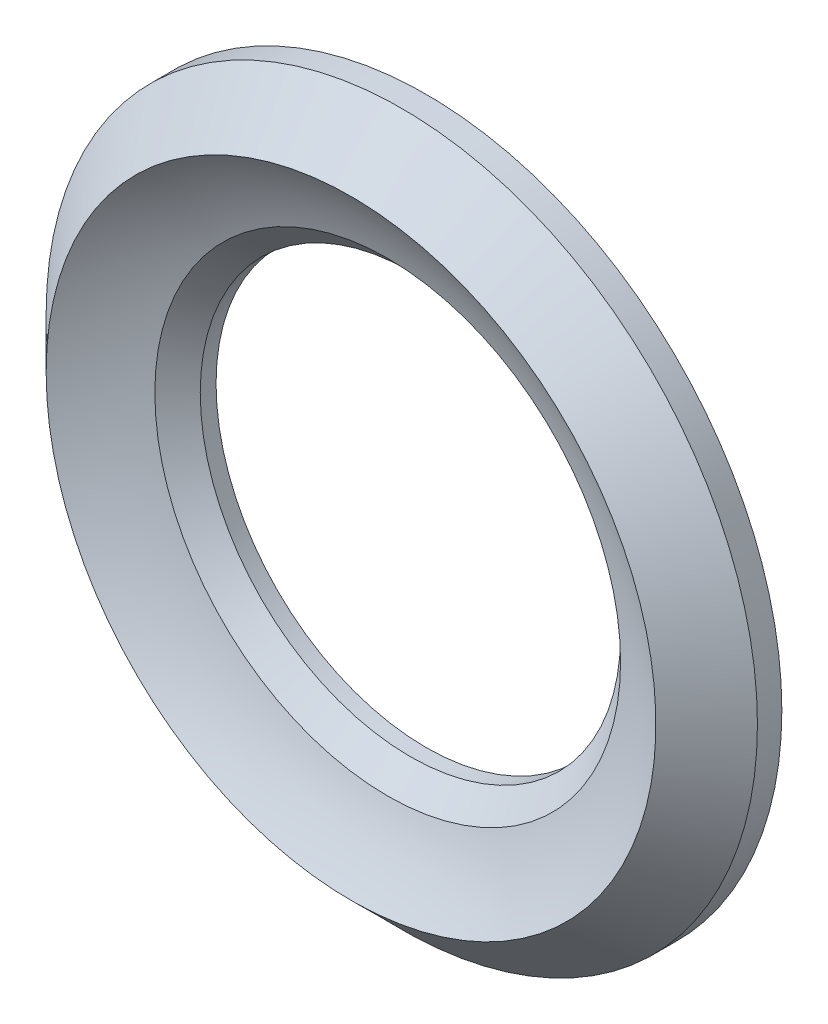
ISO-10303-21;
HEADER;
FILE_DESCRIPTION(('STEP AP214'),'2;1');
FILE_NAME('part.step','',(''),(''),'','','');
FILE_SCHEMA(('AUTOMOTIVE_DESIGN { 1 0 10303 214 1 1 1 1 }'));
ENDSEC;
DATA;
#1=APPLICATION_CONTEXT('core data for automotive mechanical design processes');
#2=APPLICATION_PROTOCOL_DEFINITION('international standard','automotive_design',2000,#1);
#3=PRODUCT_CONTEXT('',#1,'mechanical');
#4=PRODUCT('Part','Part','',(#3));
#5=PRODUCT_RELATED_PRODUCT_CATEGORY('part','',(#4));
#6=PRODUCT_DEFINITION_FORMATION('','',#4);
#7=PRODUCT_DEFINITION_CONTEXT('part definition',#1,'design');
#8=PRODUCT_DEFINITION('design','',#6,#7);
#9=PRODUCT_DEFINITION_SHAPE('','',#8);
#10=(LENGTH_UNIT() NAMED_UNIT(*) SI_UNIT(.MILLI.,.METRE.));
#11=(NAMED_UNIT(*) PLANE_ANGLE_UNIT() SI_UNIT($,.RADIAN.));
#12=(NAMED_UNIT(*) SI_UNIT($,.STERADIAN.) SOLID_ANGLE_UNIT());
#13=UNCERTAINTY_MEASURE_WITH_UNIT(LENGTH_MEASURE(1.E-05),#10,'distance_accuracy_value','');
#14=(GEOMETRIC_REPRESENTATION_CONTEXT(3) GLOBAL_UNCERTAINTY_ASSIGNED_CONTEXT((#13)) GLOBAL_UNIT_ASSIGNED_CONTEXT((#10,
#11,#12)) REPRESENTATION_CONTEXT('',''));
#15=CARTESIAN_POINT('',(0.,0.,0.));
#16=DIRECTION('',(0.,0.,1.));
#17=DIRECTION('',(1.,0.,0.));
#18=AXIS2_PLACEMENT_3D('',#15,#16,#17);
#19=CARTESIAN_POINT('',(0.,22.,3.99999999999999));
#20=DIRECTION('',(0.,0.,-1.));
#21=DIRECTION('',(-1.,0.,0.));
#22=AXIS2_PLACEMENT_3D('',#19,#20,#21);
#23=PLANE('',#22);
#24=CARTESIAN_POINT('',(-6.69696006638897,-16.1678918189476,3.99999999999999));
#25=DIRECTION('',(0.,0.,-1.));
#26=DIRECTION('',(-1.,0.,0.));
#27=AXIS2_PLACEMENT_3D('',#24,#25,#26);
#28=CIRCLE('',#27,0.799999999999998);
#29=CARTESIAN_POINT('',(-7.49696006638897,-16.1678918189476,3.99999999999999));
#30=VERTEX_POINT('',#29);
#31=EDGE_CURVE('E76',#30,#30,#28,.T.);
#32=ORIENTED_EDGE('',*,*,#31,.F.);
#33=EDGE_LOOP('',(#32));
#34=FACE_BOUND('',#33,.T.);
#35=CARTESIAN_POINT('',(16.1678918189475,-6.69696006638914,3.99999999999999));
#36=DIRECTION('',(0.,0.,-1.));
#37=DIRECTION('',(-1.,0.,0.));
#38=AXIS2_PLACEMENT_3D('',#35,#36,#37);
#39=CIRCLE('',#38,0.799999999999997);
#40=CARTESIAN_POINT('',(15.3678918189475,-6.69696006638914,3.99999999999999));
#41=VERTEX_POINT('',#40);
#42=EDGE_CURVE('E84',#41,#41,#39,.T.);
#43=ORIENTED_EDGE('',*,*,#42,.F.);
#44=EDGE_LOOP('',(#43));
#45=FACE_BOUND('',#44,.T.);
#46=CARTESIAN_POINT('',(6.69696006638897,-16.1678918189476,3.99999999999999));
#47=DIRECTION('',(0.,0.,-1.));
#48=DIRECTION('',(-1.,0.,0.));
#49=AXIS2_PLACEMENT_3D('',#46,#47,#48);
#50=CIRCLE('',#49,0.799999999999998);
#51=CARTESIAN_POINT('',(5.89696006638898,-16.1678918189476,3.99999999999999));
#52=VERTEX_POINT('',#51);
#53=EDGE_CURVE('E88',#52,#52,#50,.T.);
#54=ORIENTED_EDGE('',*,*,#53,.F.);
#55=EDGE_LOOP('',(#54));
#56=FACE_BOUND('',#55,.T.);
#57=CARTESIAN_POINT('',(-16.1678918189475,-6.69696006638914,3.99999999999999));
#58=DIRECTION('',(0.,0.,-1.));
#59=DIRECTION('',(-1.,0.,0.));
#60=AXIS2_PLACEMENT_3D('',#57,#58,#59);
#61=CIRCLE('',#60,0.799999999999998);
#62=CARTESIAN_POINT('',(-16.9678918189475,-6.69696006638914,3.99999999999999));
#63=VERTEX_POINT('',#62);
#64=EDGE_CURVE('E92',#63,#63,#61,.T.);
#65=ORIENTED_EDGE('',*,*,#64,.F.);
#66=EDGE_LOOP('',(#65));
#67=FACE_BOUND('',#66,.T.);
#68=CARTESIAN_POINT('',(-6.69696006638897,16.1678918189476,3.99999999999999));
#69=DIRECTION('',(0.,0.,-1.));
#70=DIRECTION('',(-1.,0.,0.));
#71=AXIS2_PLACEMENT_3D('',#68,#69,#70);
#72=CIRCLE('',#71,0.799999999999998);
#73=CARTESIAN_POINT('',(-7.49696006638897,16.1678918189476,3.99999999999999));
#74=VERTEX_POINT('',#73);
#75=EDGE_CURVE('E96',#74,#74,#72,.T.);
#76=ORIENTED_EDGE('',*,*,#75,.F.);
#77=EDGE_LOOP('',(#76));
#78=FACE_BOUND('',#77,.T.);
#79=CARTESIAN_POINT('',(16.1678918189475,6.69696006638914,3.99999999999999));
#80=DIRECTION('',(0.,0.,-1.));
#81=DIRECTION('',(-1.,0.,0.));
#82=AXIS2_PLACEMENT_3D('',#79,#80,#81);
#83=CIRCLE('',#82,0.799999999999997);
#84=CARTESIAN_POINT('',(15.3678918189475,6.69696006638914,3.99999999999999));
#85=VERTEX_POINT('',#84);
#86=EDGE_CURVE('E100',#85,#85,#83,.T.);
#87=ORIENTED_EDGE('',*,*,#86,.F.);
#88=EDGE_LOOP('',(#87));
#89=FACE_BOUND('',#88,.T.);
#90=CARTESIAN_POINT('',(6.69696006638897,16.1678918189476,3.99999999999999));
#91=DIRECTION('',(0.,0.,-1.));
#92=DIRECTION('',(-1.,0.,0.));
#93=AXIS2_PLACEMENT_3D('',#90,#91,#92);
#94=CIRCLE('',#93,0.799999999999998);
#95=CARTESIAN_POINT('',(5.89696006638898,16.1678918189476,3.99999999999999));
#96=VERTEX_POINT('',#95);
#97=EDGE_CURVE('E104',#96,#96,#94,.T.);
#98=ORIENTED_EDGE('',*,*,#97,.F.);
#99=EDGE_LOOP('',(#98));
#100=FACE_BOUND('',#99,.T.);
#101=CARTESIAN_POINT('',(-16.1678918189475,6.69696006638914,3.99999999999999));
#102=DIRECTION('',(0.,0.,-1.));
#103=DIRECTION('',(-1.,0.,0.));
#104=AXIS2_PLACEMENT_3D('',#101,#102,#103);
#105=CIRCLE('',#104,0.799999999999998);
#106=CARTESIAN_POINT('',(-16.9678918189475,6.69696006638914,3.99999999999999));
#107=VERTEX_POINT('',#106);
#108=EDGE_CURVE('E108',#107,#107,#105,.T.);
#109=ORIENTED_EDGE('',*,*,#108,.F.);
#110=EDGE_LOOP('',(#109));
#111=FACE_BOUND('',#110,.T.);
#112=CARTESIAN_POINT('',(0.,0.,3.99999999999999));
#113=DIRECTION('',(0.,0.,-1.));
#114=DIRECTION('',(-1.,0.,0.));
#115=AXIS2_PLACEMENT_3D('',#112,#113,#114);
#116=CIRCLE('',#115,22.);
#117=CARTESIAN_POINT('',(-22.,0.,3.99999999999999));
#118=VERTEX_POINT('',#117);
#119=EDGE_CURVE('E109',#118,#118,#116,.T.);
#120=ORIENTED_EDGE('',*,*,#119,.T.);
#121=EDGE_LOOP('',(#120));
#122=FACE_BOUND('',#121,.T.);
#123=CARTESIAN_POINT('',(0.,0.,3.99999999999999));
#124=DIRECTION('',(0.,0.,-1.));
#125=DIRECTION('',(-1.,0.,0.));
#126=AXIS2_PLACEMENT_3D('',#123,#124,#125);
#127=CIRCLE('',#126,13.);
#128=CARTESIAN_POINT('',(-13.,0.,3.99999999999999));
#129=VERTEX_POINT('',#128);
#130=EDGE_CURVE('E118',#129,#129,#127,.T.);
#131=ORIENTED_EDGE('',*,*,#130,.F.);
#132=EDGE_LOOP('',(#131));
#133=FACE_BOUND('',#132,.T.);
#134=ADVANCED_FACE('F33',(#34,#45,#56,#67,#78,#89,#100,#111,#122,#133),#23,.T.);
#135=CARTESIAN_POINT('',(0.,0.,0.));
#136=DIRECTION('',(0.,0.,-1.));
#137=DIRECTION('',(-1.,0.,0.));
#138=AXIS2_PLACEMENT_3D('',#135,#136,#137);
#139=CYLINDRICAL_SURFACE('',#138,13.);
#140=CARTESIAN_POINT('',(0.,0.,4.9772883581417));
#141=DIRECTION('',(0.,0.,1.));
#142=DIRECTION('',(1.,0.,0.));
#143=AXIS2_PLACEMENT_3D('',#140,#141,#142);
#144=CIRCLE('',#143,13.);
#145=CARTESIAN_POINT('',(13.,0.,4.9772883581417));
#146=VERTEX_POINT('',#145);
#147=EDGE_CURVE('E11',#146,#146,#144,.T.);
#148=ORIENTED_EDGE('',*,*,#147,.T.);
#149=EDGE_LOOP('',(#148));
#150=FACE_BOUND('',#149,.T.);
#151=ORIENTED_EDGE('',*,*,#130,.T.);
#152=EDGE_LOOP('',(#151));
#153=FACE_BOUND('',#152,.T.);
#154=ADVANCED_FACE('F149',(#150,#153),#139,.F.);
#155=CARTESIAN_POINT('',(0.,0.,22.5));
#156=DIRECTION('',(0.,0.,-1.));
#157=DIRECTION('',(-1.,0.,0.));
#158=AXIS2_PLACEMENT_3D('',#155,#156,#157);
#159=DEGENERATE_TOROIDAL_SURFACE('',#158,9.,17.,.T.);
#160=CARTESIAN_POINT('',(0.,0.,6.38203882723148));
#161=DIRECTION('',(0.,0.,1.));
#162=DIRECTION('',(1.,0.,0.));
#163=AXIS2_PLACEMENT_3D('',#160,#161,#162);
#164=CIRCLE('',#163,14.4047504690898);
#165=CARTESIAN_POINT('',(14.4047504690898,0.,6.38203882723148));
#166=VERTEX_POINT('',#165);
#167=EDGE_CURVE('E41',#166,#166,#164,.F.);
#168=ORIENTED_EDGE('',*,*,#167,.T.);
#169=EDGE_LOOP('',(#168));
#170=FACE_BOUND('',#169,.T.);
#171=CARTESIAN_POINT('',(0.,0.,8.65090884748535));
#172=DIRECTION('',(0.,0.,-1.));
#173=DIRECTION('',(-1.,0.,0.));
#174=AXIS2_PLACEMENT_3D('',#171,#172,#173);
#175=CIRCLE('',#174,18.8591416588535);
#176=CARTESIAN_POINT('',(-18.8591416588535,0.,8.65090884748535));
#177=VERTEX_POINT('',#176);
#178=EDGE_CURVE('E115',#177,#177,#175,.T.);
#179=ORIENTED_EDGE('',*,*,#178,.F.);
#180=EDGE_LOOP('',(#179));
#181=FACE_BOUND('',#180,.T.);
#182=ADVANCED_FACE('F137',(#170,#181),#159,.F.);
#183=CARTESIAN_POINT('',(0.,0.,5.51005050633884));
#184=DIRECTION('',(0.,0.,-1.));
#185=DIRECTION('',(-1.,0.,0.));
#186=AXIS2_PLACEMENT_3D('',#183,#184,#185);
#187=CONICAL_SURFACE('',#186,22.,0.785398163397448);
#188=ORIENTED_EDGE('',*,*,#178,.T.);
#189=EDGE_LOOP('',(#188));
#190=FACE_BOUND('',#189,.T.);
#191=CARTESIAN_POINT('',(0.,0.,5.51005050633884));
#192=DIRECTION('',(0.,0.,-1.));
#193=DIRECTION('',(-1.,0.,0.));
#194=AXIS2_PLACEMENT_3D('',#191,#192,#193);
#195=CIRCLE('',#194,22.);
#196=CARTESIAN_POINT('',(-22.,0.,5.51005050633884));
#197=VERTEX_POINT('',#196);
#198=EDGE_CURVE('E112',#197,#197,#195,.T.);
#199=ORIENTED_EDGE('',*,*,#198,.F.);
#200=EDGE_LOOP('',(#199));
#201=FACE_BOUND('',#200,.T.);
#202=ADVANCED_FACE('F161',(#190,#201),#187,.T.);
#203=CARTESIAN_POINT('',(0.,0.,0.));
#204=DIRECTION('',(0.,0.,-1.));
#205=DIRECTION('',(-1.,0.,0.));
#206=AXIS2_PLACEMENT_3D('',#203,#204,#205);
#207=CYLINDRICAL_SURFACE('',#206,22.);
#208=ORIENTED_EDGE('',*,*,#198,.T.);
#209=EDGE_LOOP('',(#208));
#210=FACE_BOUND('',#209,.T.);
#211=ORIENTED_EDGE('',*,*,#119,.F.);
#212=EDGE_LOOP('',(#211));
#213=FACE_BOUND('',#212,.T.);
#214=ADVANCED_FACE('F164',(#210,#213),#207,.T.);
#215=CARTESIAN_POINT('',(-16.1678918189475,6.69696006638914,6.5));
#216=DIRECTION('',(0.,0.,-1.));
#217=DIRECTION('',(0.,1.,0.));
#218=AXIS2_PLACEMENT_3D('',#215,#216,#217);
#219=CONICAL_SURFACE('',#218,0.799999999999997,1.02974425867665);
#220=CARTESIAN_POINT('',(-16.1678918189475,6.69696006638914,6.98068849522205));
#221=VERTEX_POINT('',#220);
#222=VERTEX_LOOP('',#221);
#223=FACE_BOUND('',#222,.T.);
#224=CARTESIAN_POINT('',(-16.1678918189475,6.69696006638914,6.5));
#225=DIRECTION('',(0.,0.,-1.));
#226=DIRECTION('',(0.,1.,0.));
#227=AXIS2_PLACEMENT_3D('',#224,#225,#226);
#228=CIRCLE('',#227,0.799999999999997);
#229=CARTESIAN_POINT('',(-16.1678918189475,7.49696006638914,6.5));
#230=VERTEX_POINT('',#229);
#231=EDGE_CURVE('E105',#230,#230,#228,.T.);
#232=ORIENTED_EDGE('',*,*,#231,.T.);
#233=EDGE_LOOP('',(#232));
#234=FACE_BOUND('',#233,.T.);
#235=ADVANCED_FACE('F168',(#223,#234),#219,.F.);
#236=CARTESIAN_POINT('',(-16.1678918189475,6.69696006638914,-5.5));
#237=DIRECTION('',(0.,0.,-1.));
#238=DIRECTION('',(0.,1.,0.));
#239=AXIS2_PLACEMENT_3D('',#236,#237,#238);
#240=CYLINDRICAL_SURFACE('',#239,0.799999999999998);
#241=ORIENTED_EDGE('',*,*,#108,.T.);
#242=EDGE_LOOP('',(#241));
#243=FACE_BOUND('',#242,.T.);
#244=ORIENTED_EDGE('',*,*,#231,.F.);
#245=EDGE_LOOP('',(#244));
#246=FACE_BOUND('',#245,.T.);
#247=ADVANCED_FACE('F172',(#243,#246),#240,.F.);
#248=CARTESIAN_POINT('',(6.69696006638897,16.1678918189476,6.5));
#249=DIRECTION('',(0.,0.,-1.));
#250=DIRECTION('',(0.,1.,0.));
#251=AXIS2_PLACEMENT_3D('',#248,#249,#250);
#252=CONICAL_SURFACE('',#251,0.799999999999997,1.02974425867665);
#253=CARTESIAN_POINT('',(6.69696006638897,16.1678918189476,6.98068849522205));
#254=VERTEX_POINT('',#253);
#255=VERTEX_LOOP('',#254);
#256=FACE_BOUND('',#255,.T.);
#257=CARTESIAN_POINT('',(6.69696006638897,16.1678918189476,6.5));
#258=DIRECTION('',(0.,0.,-1.));
#259=DIRECTION('',(0.,1.,0.));
#260=AXIS2_PLACEMENT_3D('',#257,#258,#259);
#261=CIRCLE('',#260,0.799999999999997);
#262=CARTESIAN_POINT('',(6.69696006638897,16.9678918189476,6.5));
#263=VERTEX_POINT('',#262);
#264=EDGE_CURVE('E101',#263,#263,#261,.T.);
#265=ORIENTED_EDGE('',*,*,#264,.T.);
#266=EDGE_LOOP('',(#265));
#267=FACE_BOUND('',#266,.T.);
#268=ADVANCED_FACE('F175',(#256,#267),#252,.F.);
#269=CARTESIAN_POINT('',(6.69696006638897,16.1678918189476,-5.5));
#270=DIRECTION('',(0.,0.,-1.));
#271=DIRECTION('',(0.,1.,0.));
#272=AXIS2_PLACEMENT_3D('',#269,#270,#271);
#273=CYLINDRICAL_SURFACE('',#272,0.799999999999998);
#274=ORIENTED_EDGE('',*,*,#97,.T.);
#275=EDGE_LOOP('',(#274));
#276=FACE_BOUND('',#275,.T.);
#277=ORIENTED_EDGE('',*,*,#264,.F.);
#278=EDGE_LOOP('',(#277));
#279=FACE_BOUND('',#278,.T.);
#280=ADVANCED_FACE('F179',(#276,#279),#273,.F.);
#281=CARTESIAN_POINT('',(16.1678918189475,6.69696006638914,6.5));
#282=DIRECTION('',(0.,0.,-1.));
#283=DIRECTION('',(0.,1.,0.));
#284=AXIS2_PLACEMENT_3D('',#281,#282,#283);
#285=CONICAL_SURFACE('',#284,0.799999999999995,1.02974425867665);
#286=CARTESIAN_POINT('',(16.1678918189475,6.69696006638914,6.98068849522205));
#287=VERTEX_POINT('',#286);
#288=VERTEX_LOOP('',#287);
#289=FACE_BOUND('',#288,.T.);
#290=CARTESIAN_POINT('',(16.1678918189475,6.69696006638914,6.5));
#291=DIRECTION('',(0.,0.,-1.));
#292=DIRECTION('',(0.,1.,0.));
#293=AXIS2_PLACEMENT_3D('',#290,#291,#292);
#294=CIRCLE('',#293,0.799999999999995);
#295=CARTESIAN_POINT('',(16.1678918189475,7.49696006638913,6.5));
#296=VERTEX_POINT('',#295);
#297=EDGE_CURVE('E97',#296,#296,#294,.T.);
#298=ORIENTED_EDGE('',*,*,#297,.T.);
#299=EDGE_LOOP('',(#298));
#300=FACE_BOUND('',#299,.T.);
#301=ADVANCED_FACE('F182',(#289,#300),#285,.F.);
#302=CARTESIAN_POINT('',(16.1678918189475,6.69696006638914,-5.5));
#303=DIRECTION('',(0.,0.,-1.));
#304=DIRECTION('',(0.,1.,0.));
#305=AXIS2_PLACEMENT_3D('',#302,#303,#304);
#306=CYLINDRICAL_SURFACE('',#305,0.799999999999997);
#307=ORIENTED_EDGE('',*,*,#86,.T.);
#308=EDGE_LOOP('',(#307));
#309=FACE_BOUND('',#308,.T.);
#310=ORIENTED_EDGE('',*,*,#297,.F.);
#311=EDGE_LOOP('',(#310));
#312=FACE_BOUND('',#311,.T.);
#313=ADVANCED_FACE('F186',(#309,#312),#306,.F.);
#314=CARTESIAN_POINT('',(-6.69696006638897,16.1678918189476,6.5));
#315=DIRECTION('',(0.,0.,-1.));
#316=DIRECTION('',(0.,1.,0.));
#317=AXIS2_PLACEMENT_3D('',#314,#315,#316);
#318=CONICAL_SURFACE('',#317,0.799999999999997,1.02974425867665);
#319=CARTESIAN_POINT('',(-6.69696006638898,16.1678918189476,6.98068849522205));
#320=VERTEX_POINT('',#319);
#321=VERTEX_LOOP('',#320);
#322=FACE_BOUND('',#321,.T.);
#323=CARTESIAN_POINT('',(-6.69696006638897,16.1678918189476,6.5));
#324=DIRECTION('',(0.,0.,-1.));
#325=DIRECTION('',(0.,1.,0.));
#326=AXIS2_PLACEMENT_3D('',#323,#324,#325);
#327=CIRCLE('',#326,0.799999999999997);
#328=CARTESIAN_POINT('',(-6.69696006638897,16.9678918189476,6.5));
#329=VERTEX_POINT('',#328);
#330=EDGE_CURVE('E93',#329,#329,#327,.T.);
#331=ORIENTED_EDGE('',*,*,#330,.T.);
#332=EDGE_LOOP('',(#331));
#333=FACE_BOUND('',#332,.T.);
#334=ADVANCED_FACE('F190',(#322,#333),#318,.F.);
#335=CARTESIAN_POINT('',(-6.69696006638897,16.1678918189476,-5.5));
#336=DIRECTION('',(0.,0.,-1.));
#337=DIRECTION('',(0.,1.,0.));
#338=AXIS2_PLACEMENT_3D('',#335,#336,#337);
#339=CYLINDRICAL_SURFACE('',#338,0.799999999999998);
#340=ORIENTED_EDGE('',*,*,#75,.T.);
#341=EDGE_LOOP('',(#340));
#342=FACE_BOUND('',#341,.T.);
#343=ORIENTED_EDGE('',*,*,#330,.F.);
#344=EDGE_LOOP('',(#343));
#345=FACE_BOUND('',#344,.T.);
#346=ADVANCED_FACE('F194',(#342,#345),#339,.F.);
#347=CARTESIAN_POINT('',(-16.1678918189475,-6.69696006638914,6.5));
#348=DIRECTION('',(0.,0.,-1.));
#349=DIRECTION('',(0.,1.,0.));
#350=AXIS2_PLACEMENT_3D('',#347,#348,#349);
#351=CONICAL_SURFACE('',#350,0.799999999999997,1.02974425867665);
#352=CARTESIAN_POINT('',(-16.1678918189475,-6.69696006638914,6.98068849522205));
#353=VERTEX_POINT('',#352);
#354=VERTEX_LOOP('',#353);
#355=FACE_BOUND('',#354,.T.);
#356=CARTESIAN_POINT('',(-16.1678918189475,-6.69696006638914,6.5));
#357=DIRECTION('',(0.,0.,-1.));
#358=DIRECTION('',(0.,1.,0.));
#359=AXIS2_PLACEMENT_3D('',#356,#357,#358);
#360=CIRCLE('',#359,0.799999999999997);
#361=CARTESIAN_POINT('',(-16.1678918189475,-5.89696006638914,6.5));
#362=VERTEX_POINT('',#361);
#363=EDGE_CURVE('E89',#362,#362,#360,.T.);
#364=ORIENTED_EDGE('',*,*,#363,.T.);
#365=EDGE_LOOP('',(#364));
#366=FACE_BOUND('',#365,.T.);
#367=ADVANCED_FACE('F198',(#355,#366),#351,.F.);
#368=CARTESIAN_POINT('',(-16.1678918189475,-6.69696006638914,-5.5));
#369=DIRECTION('',(0.,0.,-1.));
#370=DIRECTION('',(0.,1.,0.));
#371=AXIS2_PLACEMENT_3D('',#368,#369,#370);
#372=CYLINDRICAL_SURFACE('',#371,0.799999999999998);
#373=ORIENTED_EDGE('',*,*,#64,.T.);
#374=EDGE_LOOP('',(#373));
#375=FACE_BOUND('',#374,.T.);
#376=ORIENTED_EDGE('',*,*,#363,.F.);
#377=EDGE_LOOP('',(#376));
#378=FACE_BOUND('',#377,.T.);
#379=ADVANCED_FACE('F202',(#375,#378),#372,.F.);
#380=CARTESIAN_POINT('',(6.69696006638897,-16.1678918189476,6.5));
#381=DIRECTION('',(0.,0.,-1.));
#382=DIRECTION('',(0.,1.,0.));
#383=AXIS2_PLACEMENT_3D('',#380,#381,#382);
#384=CONICAL_SURFACE('',#383,0.799999999999997,1.02974425867665);
#385=CARTESIAN_POINT('',(6.69696006638897,-16.1678918189476,6.98068849522205));
#386=VERTEX_POINT('',#385);
#387=VERTEX_LOOP('',#386);
#388=FACE_BOUND('',#387,.T.);
#389=CARTESIAN_POINT('',(6.69696006638897,-16.1678918189476,6.5));
#390=DIRECTION('',(0.,0.,-1.));
#391=DIRECTION('',(0.,1.,0.));
#392=AXIS2_PLACEMENT_3D('',#389,#390,#391);
#393=CIRCLE('',#392,0.799999999999997);
#394=CARTESIAN_POINT('',(6.69696006638897,-15.3678918189476,6.5));
#395=VERTEX_POINT('',#394);
#396=EDGE_CURVE('E85',#395,#395,#393,.T.);
#397=ORIENTED_EDGE('',*,*,#396,.T.);
#398=EDGE_LOOP('',(#397));
#399=FACE_BOUND('',#398,.T.);
#400=ADVANCED_FACE('F206',(#388,#399),#384,.F.);
#401=CARTESIAN_POINT('',(6.69696006638897,-16.1678918189476,-5.5));
#402=DIRECTION('',(0.,0.,-1.));
#403=DIRECTION('',(0.,1.,0.));
#404=AXIS2_PLACEMENT_3D('',#401,#402,#403);
#405=CYLINDRICAL_SURFACE('',#404,0.799999999999998);
#406=ORIENTED_EDGE('',*,*,#53,.T.);
#407=EDGE_LOOP('',(#406));
#408=FACE_BOUND('',#407,.T.);
#409=ORIENTED_EDGE('',*,*,#396,.F.);
#410=EDGE_LOOP('',(#409));
#411=FACE_BOUND('',#410,.T.);
#412=ADVANCED_FACE('F210',(#408,#411),#405,.F.);
#413=CARTESIAN_POINT('',(16.1678918189475,-6.69696006638914,6.5));
#414=DIRECTION('',(0.,0.,-1.));
#415=DIRECTION('',(0.,1.,0.));
#416=AXIS2_PLACEMENT_3D('',#413,#414,#415);
#417=CONICAL_SURFACE('',#416,0.799999999999995,1.02974425867665);
#418=CARTESIAN_POINT('',(16.1678918189475,-6.69696006638914,6.98068849522205));
#419=VERTEX_POINT('',#418);
#420=VERTEX_LOOP('',#419);
#421=FACE_BOUND('',#420,.T.);
#422=CARTESIAN_POINT('',(16.1678918189475,-6.69696006638914,6.5));
#423=DIRECTION('',(0.,0.,-1.));
#424=DIRECTION('',(0.,1.,0.));
#425=AXIS2_PLACEMENT_3D('',#422,#423,#424);
#426=CIRCLE('',#425,0.799999999999995);
#427=CARTESIAN_POINT('',(16.1678918189475,-5.89696006638914,6.5));
#428=VERTEX_POINT('',#427);
#429=EDGE_CURVE('E79',#428,#428,#426,.T.);
#430=ORIENTED_EDGE('',*,*,#429,.T.);
#431=EDGE_LOOP('',(#430));
#432=FACE_BOUND('',#431,.T.);
#433=ADVANCED_FACE('F214',(#421,#432),#417,.F.);
#434=CARTESIAN_POINT('',(16.1678918189475,-6.69696006638914,-5.5));
#435=DIRECTION('',(0.,0.,-1.));
#436=DIRECTION('',(0.,1.,0.));
#437=AXIS2_PLACEMENT_3D('',#434,#435,#436);
#438=CYLINDRICAL_SURFACE('',#437,0.799999999999997);
#439=ORIENTED_EDGE('',*,*,#42,.T.);
#440=EDGE_LOOP('',(#439));
#441=FACE_BOUND('',#440,.T.);
#442=ORIENTED_EDGE('',*,*,#429,.F.);
#443=EDGE_LOOP('',(#442));
#444=FACE_BOUND('',#443,.T.);
#445=ADVANCED_FACE('F70',(#441,#444),#438,.F.);
#446=CARTESIAN_POINT('',(-6.69696006638897,-16.1678918189476,6.5));
#447=DIRECTION('',(0.,0.,-1.));
#448=DIRECTION('',(0.,1.,0.));
#449=AXIS2_PLACEMENT_3D('',#446,#447,#448);
#450=CONICAL_SURFACE('',#449,0.799999999999997,1.02974425867665);
#451=CARTESIAN_POINT('',(-6.69696006638898,-16.1678918189476,6.98068849522205));
#452=VERTEX_POINT('',#451);
#453=VERTEX_LOOP('',#452);
#454=FACE_BOUND('',#453,.T.);
#455=CARTESIAN_POINT('',(-6.69696006638897,-16.1678918189476,6.5));
#456=DIRECTION('',(0.,0.,-1.));
#457=DIRECTION('',(0.,1.,0.));
#458=AXIS2_PLACEMENT_3D('',#455,#456,#457);
#459=CIRCLE('',#458,0.799999999999997);
#460=CARTESIAN_POINT('',(-6.69696006638897,-15.3678918189476,6.5));
#461=VERTEX_POINT('',#460);
#462=EDGE_CURVE('E74',#461,#461,#459,.T.);
#463=ORIENTED_EDGE('',*,*,#462,.T.);
#464=EDGE_LOOP('',(#463));
#465=FACE_BOUND('',#464,.T.);
#466=ADVANCED_FACE('F66',(#454,#465),#450,.F.);
#467=CARTESIAN_POINT('',(-6.69696006638897,-16.1678918189476,-5.5));
#468=DIRECTION('',(0.,0.,-1.));
#469=DIRECTION('',(0.,1.,0.));
#470=AXIS2_PLACEMENT_3D('',#467,#468,#469);
#471=CYLINDRICAL_SURFACE('',#470,0.799999999999998);
#472=ORIENTED_EDGE('',*,*,#31,.T.);
#473=EDGE_LOOP('',(#472));
#474=FACE_BOUND('',#473,.T.);
#475=ORIENTED_EDGE('',*,*,#462,.F.);
#476=EDGE_LOOP('',(#475));
#477=FACE_BOUND('',#476,.T.);
#478=ADVANCED_FACE('F69',(#474,#477),#471,.F.);
#479=CARTESIAN_POINT('',(0.,0.,6.38203882723147));
#480=DIRECTION('',(0.,0.,1.));
#481=DIRECTION('',(1.,0.,0.));
#482=AXIS2_PLACEMENT_3D('',#479,#480,#481);
#483=CONICAL_SURFACE('',#482,14.4047504690898,0.785398163397448);
#484=CARTESIAN_POINT('',(13.,0.,4.9772883581417));
#485=CARTESIAN_POINT('',(13.0146328173864,0.,4.99192117552805));
#486=CARTESIAN_POINT('',(13.0292656347727,0.,5.0065539929144));
#487=CARTESIAN_POINT('',(13.0585312695454,0.,5.0358196276871));
#488=CARTESIAN_POINT('',(13.0731640869318,0.,5.05045244507346));
#489=CARTESIAN_POINT('',(13.1024297217045,0.,5.07971807984616));
#490=CARTESIAN_POINT('',(13.1170625390908,0.,5.09435089723251));
#491=CARTESIAN_POINT('',(13.1463281738635,0.,5.12361653200522));
#492=CARTESIAN_POINT('',(13.1609609912499,0.,5.13824934939157));
#493=CARTESIAN_POINT('',(13.1902266260226,0.,5.16751498416427));
#494=CARTESIAN_POINT('',(13.2048594434089,0.,5.18214780155062));
#495=CARTESIAN_POINT('',(13.2341250781816,0.,5.21141343632333));
#496=CARTESIAN_POINT('',(13.248757895568,0.,5.22604625370968));
#497=CARTESIAN_POINT('',(13.2780235303407,0.,5.25531188848238));
#498=CARTESIAN_POINT('',(13.292656347727,0.,5.26994470586873));
#499=CARTESIAN_POINT('',(13.3219219824997,0.,5.29921034064144));
#500=CARTESIAN_POINT('',(13.3365547998861,0.,5.31384315802779));
#501=CARTESIAN_POINT('',(13.3658204346588,0.,5.34310879280049));
#502=CARTESIAN_POINT('',(13.3804532520451,0.,5.35774161018684));
#503=CARTESIAN_POINT('',(13.4097188868179,0.,5.38700724495955));
#504=CARTESIAN_POINT('',(13.4243517042042,0.,5.4016400623459));
#505=CARTESIAN_POINT('',(13.4536173389769,0.,5.4309056971186));
#506=CARTESIAN_POINT('',(13.4682501563633,0.,5.44553851450496));
#507=CARTESIAN_POINT('',(13.497515791136,0.,5.47480414927766));
#508=CARTESIAN_POINT('',(13.5121486085223,0.,5.48943696666401));
#509=CARTESIAN_POINT('',(13.541414243295,0.,5.51870260143672));
#510=CARTESIAN_POINT('',(13.5560470606814,0.,5.53333541882307));
#511=CARTESIAN_POINT('',(13.5853126954541,0.,5.56260105359577));
#512=CARTESIAN_POINT('',(13.5999455128404,0.,5.57723387098212));
#513=CARTESIAN_POINT('',(13.6292111476131,0.,5.60649950575483));
#514=CARTESIAN_POINT('',(13.6438439649995,0.,5.62113232314118));
#515=CARTESIAN_POINT('',(13.6731095997722,0.,5.65039795791388));
#516=CARTESIAN_POINT('',(13.6877424171585,0.,5.66503077530023));
#517=CARTESIAN_POINT('',(13.7170080519312,0.,5.69429641007294));
#518=CARTESIAN_POINT('',(13.7316408693176,0.,5.70892922745929));
#519=CARTESIAN_POINT('',(13.7609065040903,0.,5.73819486223199));
#520=CARTESIAN_POINT('',(13.7755393214766,0.,5.75282767961835));
#521=CARTESIAN_POINT('',(13.8048049562494,0.,5.78209331439105));
#522=CARTESIAN_POINT('',(13.8194377736357,0.,5.7967261317774));
#523=CARTESIAN_POINT('',(13.8487034084084,0.,5.82599176655011));
#524=CARTESIAN_POINT('',(13.8633362257948,0.,5.84062458393646));
#525=CARTESIAN_POINT('',(13.8926018605675,0.,5.86989021870916));
#526=CARTESIAN_POINT('',(13.9072346779538,0.,5.88452303609551));
#527=CARTESIAN_POINT('',(13.9365003127265,0.,5.91378867086822));
#528=CARTESIAN_POINT('',(13.9511331301129,0.,5.92842148825457));
#529=CARTESIAN_POINT('',(13.9803987648856,0.,5.95768712302727));
#530=CARTESIAN_POINT('',(13.9950315822719,0.,5.97231994041362));
#531=CARTESIAN_POINT('',(14.0242972170446,0.,6.00158557518633));
#532=CARTESIAN_POINT('',(14.038930034431,0.,6.01621839257268));
#533=CARTESIAN_POINT('',(14.0681956692037,0.,6.04548402734538));
#534=CARTESIAN_POINT('',(14.08282848659,0.,6.06011684473174));
#535=CARTESIAN_POINT('',(14.1120941213627,0.,6.08938247950444));
#536=CARTESIAN_POINT('',(14.1267269387491,0.,6.10401529689079));
#537=CARTESIAN_POINT('',(14.1559925735218,0.,6.13328093166349));
#538=CARTESIAN_POINT('',(14.1706253909081,0.,6.14791374904985));
#539=CARTESIAN_POINT('',(14.1998910256809,0.,6.17717938382255));
#540=CARTESIAN_POINT('',(14.2145238430672,0.,6.1918122012089));
#541=CARTESIAN_POINT('',(14.2437894778399,0.,6.22107783598161));
#542=CARTESIAN_POINT('',(14.2584222952263,0.,6.23571065336796));
#543=CARTESIAN_POINT('',(14.287687929999,0.,6.26497628814066));
#544=CARTESIAN_POINT('',(14.3023207473853,0.,6.27960910552701));
#545=CARTESIAN_POINT('',(14.331586382158,0.,6.30887474029972));
#546=CARTESIAN_POINT('',(14.3462191995444,0.,6.32350755768607));
#547=CARTESIAN_POINT('',(14.3754848343171,0.,6.35277319245877));
#548=CARTESIAN_POINT('',(14.3901176517034,0.,6.36740600984512));
#549=CARTESIAN_POINT('',(14.4047504690898,0.,6.38203882723148));
#550=B_SPLINE_CURVE_WITH_KNOTS('',3,(#484,#485,#486,#487,#488,#489,#490,#491,#492,#493,#494,
#495,#496,#497,#498,#499,#500,#501,#502,#503,#504,#505,#506,#507,#508,#509,#510,#511,#512,#513,
#514,#515,#516,#517,#518,#519,#520,#521,#522,#523,#524,#525,#526,#527,#528,#529,#530,#531,#532,
#533,#534,#535,#536,#537,#538,#539,#540,#541,#542,#543,#544,#545,#546,#547,#548,#549),
.UNSPECIFIED.,.F.,.F.,(4,2,2,2,2,2,2,2,2,2,2,2,2,2,2,2,2,2,2,2,2,2,2,2,2,2,2,2,2,2,2,2,4),(0.,
0.0620817864105234,0.124163572821046,0.186245359231569,0.248327145642092,0.310408932052615,
0.372490718463138,0.43457250487366,0.496654291284183,0.558736077694706,0.620817864105229,
0.682899650515752,0.744981436926275,0.807063223336798,0.869145009747321,0.931226796157845,
0.993308582568368,1.05539036897889,1.11747215538941,1.17955394179994,1.24163572821046,
1.30371751462098,1.36579930103151,1.42788108744203,1.48996287385255,1.55204466026307,
1.6141264466736,1.67620823308412,1.73829001949464,1.80037180590517,1.86245359231569,
1.92453537872621,1.98661716513674),.UNSPECIFIED.);
#551=EDGE_CURVE('BSEAM35',#146,#166,#550,.T.);
#552=ORIENTED_EDGE('',*,*,#147,.F.);
#553=ORIENTED_EDGE('',*,*,#167,.F.);
#554=ORIENTED_EDGE('',*,*,#551,.T.);
#555=ORIENTED_EDGE('',*,*,#551,.F.);
#556=EDGE_LOOP('',(#552,#554,#553,#555));
#557=FACE_BOUND('',#556,.T.);
#558=ADVANCED_FACE('F35',(#557),#483,.F.);
#559=CLOSED_SHELL('',(#134,#154,#182,#202,#214,#235,#247,#268,#280,#301,#313,#334,#346,#367,
#379,#400,#412,#433,#445,#466,#478,#558));
#560=MANIFOLD_SOLID_BREP('B2',#559);
#561=ADVANCED_BREP_SHAPE_REPRESENTATION('',(#18,#560),#14);
#562=SHAPE_DEFINITION_REPRESENTATION(#9,#561);
ENDSEC;
END-ISO-10303-21;
